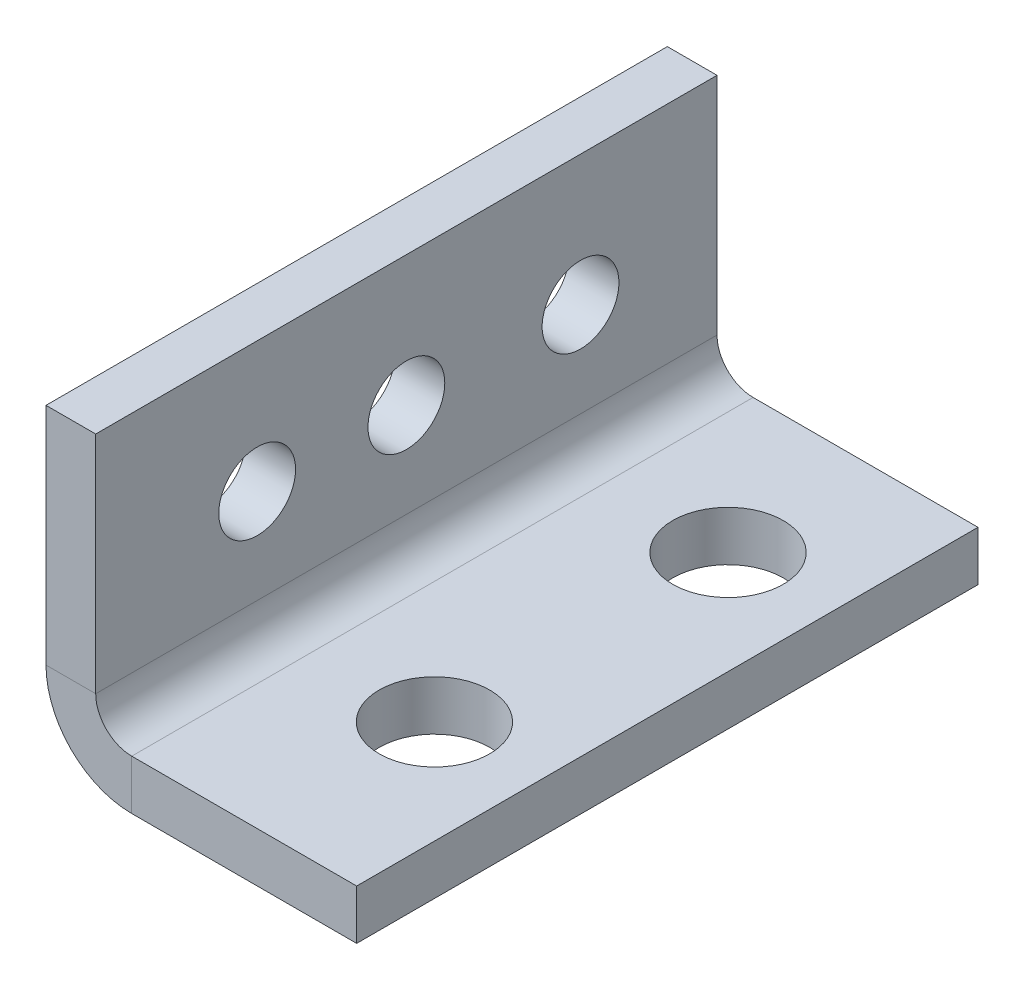
ISO-10303-21;
HEADER;
FILE_DESCRIPTION(('STEP AP214'),'2;1');
FILE_NAME('part.step','',(''),(''),'','','');
FILE_SCHEMA(('AUTOMOTIVE_DESIGN { 1 0 10303 214 1 1 1 1 }'));
ENDSEC;
DATA;
#1=APPLICATION_CONTEXT('core data for automotive mechanical design processes');
#2=APPLICATION_PROTOCOL_DEFINITION('international standard','automotive_design',2000,#1);
#3=PRODUCT_CONTEXT('',#1,'mechanical');
#4=PRODUCT('Part','Part','',(#3));
#5=PRODUCT_RELATED_PRODUCT_CATEGORY('part','',(#4));
#6=PRODUCT_DEFINITION_FORMATION('','',#4);
#7=PRODUCT_DEFINITION_CONTEXT('part definition',#1,'design');
#8=PRODUCT_DEFINITION('design','',#6,#7);
#9=PRODUCT_DEFINITION_SHAPE('','',#8);
#10=(LENGTH_UNIT() NAMED_UNIT(*) SI_UNIT(.MILLI.,.METRE.));
#11=(NAMED_UNIT(*) PLANE_ANGLE_UNIT() SI_UNIT($,.RADIAN.));
#12=(NAMED_UNIT(*) SI_UNIT($,.STERADIAN.) SOLID_ANGLE_UNIT());
#13=UNCERTAINTY_MEASURE_WITH_UNIT(LENGTH_MEASURE(1.E-05),#10,'distance_accuracy_value','');
#14=(GEOMETRIC_REPRESENTATION_CONTEXT(3) GLOBAL_UNCERTAINTY_ASSIGNED_CONTEXT((#13)) GLOBAL_UNIT_ASSIGNED_CONTEXT((#10,
#11,#12)) REPRESENTATION_CONTEXT('',''));
#15=CARTESIAN_POINT('',(0.,0.,0.));
#16=DIRECTION('',(0.,0.,1.));
#17=DIRECTION('',(1.,0.,0.));
#18=AXIS2_PLACEMENT_3D('',#15,#16,#17);
#19=CARTESIAN_POINT('',(-1.016,6.35,-12.7));
#20=DIRECTION('',(0.,0.,-1.));
#21=DIRECTION('',(-1.,0.,0.));
#22=AXIS2_PLACEMENT_3D('',#19,#20,#21);
#23=PLANE('',#22);
#24=DIRECTION('',(0.,1.,0.));
#25=VECTOR('',#24,1.);
#26=CARTESIAN_POINT('',(0.,6.35,-12.7));
#27=LINE('',#26,#25);
#28=CARTESIAN_POINT('',(0.,1.7526,-12.7));
#29=VERTEX_POINT('',#28);
#30=CARTESIAN_POINT('',(0.,6.35,-12.7));
#31=VERTEX_POINT('',#30);
#32=EDGE_CURVE('E106',#29,#31,#27,.T.);
#33=ORIENTED_EDGE('',*,*,#32,.F.);
#34=DIRECTION('',(-1.,0.,0.));
#35=VECTOR('',#34,1.);
#36=CARTESIAN_POINT('',(0.,1.7526,-12.7));
#37=LINE('',#36,#35);
#38=CARTESIAN_POINT('',(-1.016,1.7526,-12.7));
#39=VERTEX_POINT('',#38);
#40=EDGE_CURVE('E137',#29,#39,#37,.T.);
#41=ORIENTED_EDGE('',*,*,#40,.T.);
#42=DIRECTION('',(0.,1.,0.));
#43=VECTOR('',#42,1.);
#44=CARTESIAN_POINT('',(-1.016,6.35,-12.7));
#45=LINE('',#44,#43);
#46=CARTESIAN_POINT('',(-1.016,6.35,-12.7));
#47=VERTEX_POINT('',#46);
#48=EDGE_CURVE('E111',#39,#47,#45,.T.);
#49=ORIENTED_EDGE('',*,*,#48,.T.);
#50=DIRECTION('',(1.,0.,0.));
#51=VECTOR('',#50,1.);
#52=CARTESIAN_POINT('',(-1.016,6.35,-12.7));
#53=LINE('',#52,#51);
#54=EDGE_CURVE('E61',#47,#31,#53,.T.);
#55=ORIENTED_EDGE('',*,*,#54,.T.);
#56=EDGE_LOOP('',(#33,#41,#49,#55));
#57=FACE_BOUND('',#56,.T.);
#58=ADVANCED_FACE('F58',(#57),#23,.T.);
#59=CARTESIAN_POINT('',(-1.016,0.,0.));
#60=DIRECTION('',(-1.,0.,0.));
#61=DIRECTION('',(0.,0.,1.));
#62=AXIS2_PLACEMENT_3D('',#59,#60,#61);
#63=PLANE('',#62);
#64=CARTESIAN_POINT('',(-1.016,3.685,-3.3));
#65=DIRECTION('',(1.,0.,0.));
#66=DIRECTION('',(0.,0.,-1.));
#67=AXIS2_PLACEMENT_3D('',#64,#65,#66);
#68=CIRCLE('',#67,0.784999999999998);
#69=CARTESIAN_POINT('',(-1.016,3.685,-4.085));
#70=VERTEX_POINT('',#69);
#71=EDGE_CURVE('E116',#70,#70,#68,.T.);
#72=ORIENTED_EDGE('',*,*,#71,.T.);
#73=EDGE_LOOP('',(#72));
#74=FACE_BOUND('',#73,.T.);
#75=CARTESIAN_POINT('',(-1.016,3.685,-6.35));
#76=DIRECTION('',(1.,0.,0.));
#77=DIRECTION('',(0.,0.,-1.));
#78=AXIS2_PLACEMENT_3D('',#75,#76,#77);
#79=CIRCLE('',#78,0.784999999999999);
#80=CARTESIAN_POINT('',(-1.016,3.685,-7.135));
#81=VERTEX_POINT('',#80);
#82=EDGE_CURVE('E123',#81,#81,#79,.T.);
#83=ORIENTED_EDGE('',*,*,#82,.T.);
#84=EDGE_LOOP('',(#83));
#85=FACE_BOUND('',#84,.T.);
#86=CARTESIAN_POINT('',(-1.016,3.685,-9.91));
#87=DIRECTION('',(1.,0.,0.));
#88=DIRECTION('',(0.,0.,-1.));
#89=AXIS2_PLACEMENT_3D('',#86,#87,#88);
#90=CIRCLE('',#89,0.784999999999999);
#91=CARTESIAN_POINT('',(-1.016,3.685,-10.695));
#92=VERTEX_POINT('',#91);
#93=EDGE_CURVE('E129',#92,#92,#90,.T.);
#94=ORIENTED_EDGE('',*,*,#93,.T.);
#95=EDGE_LOOP('',(#94));
#96=FACE_BOUND('',#95,.T.);
#97=ORIENTED_EDGE('',*,*,#48,.F.);
#98=DIRECTION('',(0.,0.,-1.));
#99=VECTOR('',#98,1.);
#100=CARTESIAN_POINT('',(-1.016,1.7526,-12.7));
#101=LINE('',#100,#99);
#102=CARTESIAN_POINT('',(-1.016,1.7526,0.));
#103=VERTEX_POINT('',#102);
#104=EDGE_CURVE('E154',#39,#103,#101,.F.);
#105=ORIENTED_EDGE('',*,*,#104,.T.);
#106=DIRECTION('',(0.,-1.,0.));
#107=VECTOR('',#106,1.);
#108=CARTESIAN_POINT('',(-1.016,0.,0.));
#109=LINE('',#108,#107);
#110=CARTESIAN_POINT('',(-1.016,6.35,0.));
#111=VERTEX_POINT('',#110);
#112=EDGE_CURVE('E117',#111,#103,#109,.T.);
#113=ORIENTED_EDGE('',*,*,#112,.F.);
#114=DIRECTION('',(0.,0.,1.));
#115=VECTOR('',#114,1.);
#116=CARTESIAN_POINT('',(-1.016,6.35,0.));
#117=LINE('',#116,#115);
#118=EDGE_CURVE('E96',#47,#111,#117,.T.);
#119=ORIENTED_EDGE('',*,*,#118,.F.);
#120=EDGE_LOOP('',(#97,#105,#113,#119));
#121=FACE_BOUND('',#120,.T.);
#122=ADVANCED_FACE('F262',(#74,#85,#96,#121),#63,.T.);
#123=CARTESIAN_POINT('',(0.,0.,0.));
#124=DIRECTION('',(-1.,0.,0.));
#125=DIRECTION('',(0.,0.,1.));
#126=AXIS2_PLACEMENT_3D('',#123,#124,#125);
#127=PLANE('',#126);
#128=CARTESIAN_POINT('',(0.,3.685,-3.3));
#129=DIRECTION('',(1.,0.,0.));
#130=DIRECTION('',(0.,0.,-1.));
#131=AXIS2_PLACEMENT_3D('',#128,#129,#130);
#132=CIRCLE('',#131,0.784999999999998);
#133=CARTESIAN_POINT('',(0.,3.685,-4.085));
#134=VERTEX_POINT('',#133);
#135=EDGE_CURVE('E120',#134,#134,#132,.T.);
#136=ORIENTED_EDGE('',*,*,#135,.F.);
#137=EDGE_LOOP('',(#136));
#138=FACE_BOUND('',#137,.T.);
#139=CARTESIAN_POINT('',(0.,3.685,-6.35));
#140=DIRECTION('',(1.,0.,0.));
#141=DIRECTION('',(0.,0.,-1.));
#142=AXIS2_PLACEMENT_3D('',#139,#140,#141);
#143=CIRCLE('',#142,0.784999999999999);
#144=CARTESIAN_POINT('',(0.,3.685,-7.135));
#145=VERTEX_POINT('',#144);
#146=EDGE_CURVE('E126',#145,#145,#143,.T.);
#147=ORIENTED_EDGE('',*,*,#146,.F.);
#148=EDGE_LOOP('',(#147));
#149=FACE_BOUND('',#148,.T.);
#150=CARTESIAN_POINT('',(0.,3.685,-9.91));
#151=DIRECTION('',(1.,0.,0.));
#152=DIRECTION('',(0.,0.,-1.));
#153=AXIS2_PLACEMENT_3D('',#150,#151,#152);
#154=CIRCLE('',#153,0.784999999999999);
#155=CARTESIAN_POINT('',(0.,3.685,-10.695));
#156=VERTEX_POINT('',#155);
#157=EDGE_CURVE('E132',#156,#156,#154,.T.);
#158=ORIENTED_EDGE('',*,*,#157,.F.);
#159=EDGE_LOOP('',(#158));
#160=FACE_BOUND('',#159,.T.);
#161=DIRECTION('',(0.,0.,-1.));
#162=VECTOR('',#161,1.);
#163=CARTESIAN_POINT('',(0.,1.7526,-12.7));
#164=LINE('',#163,#162);
#165=CARTESIAN_POINT('',(0.,1.7526,0.));
#166=VERTEX_POINT('',#165);
#167=EDGE_CURVE('E144',#29,#166,#164,.F.);
#168=ORIENTED_EDGE('',*,*,#167,.F.);
#169=ORIENTED_EDGE('',*,*,#32,.T.);
#170=DIRECTION('',(0.,0.,1.));
#171=VECTOR('',#170,1.);
#172=CARTESIAN_POINT('',(0.,6.35,0.));
#173=LINE('',#172,#171);
#174=CARTESIAN_POINT('',(0.,6.35,0.));
#175=VERTEX_POINT('',#174);
#176=EDGE_CURVE('E94',#31,#175,#173,.T.);
#177=ORIENTED_EDGE('',*,*,#176,.T.);
#178=DIRECTION('',(0.,-1.,0.));
#179=VECTOR('',#178,1.);
#180=CARTESIAN_POINT('',(0.,0.,0.));
#181=LINE('',#180,#179);
#182=EDGE_CURVE('E103',#175,#166,#181,.T.);
#183=ORIENTED_EDGE('',*,*,#182,.T.);
#184=EDGE_LOOP('',(#168,#169,#177,#183));
#185=FACE_BOUND('',#184,.T.);
#186=ADVANCED_FACE('F101',(#138,#149,#160,#185),#127,.F.);
#187=CARTESIAN_POINT('',(-1.016,0.,0.));
#188=DIRECTION('',(0.,0.,1.));
#189=DIRECTION('',(1.,0.,0.));
#190=AXIS2_PLACEMENT_3D('',#187,#188,#189);
#191=PLANE('',#190);
#192=DIRECTION('',(-1.,0.,0.));
#193=VECTOR('',#192,1.);
#194=CARTESIAN_POINT('',(0.,1.7526,0.));
#195=LINE('',#194,#193);
#196=EDGE_CURVE('E110',#166,#103,#195,.T.);
#197=ORIENTED_EDGE('',*,*,#196,.F.);
#198=ORIENTED_EDGE('',*,*,#182,.F.);
#199=DIRECTION('',(1.,0.,0.));
#200=VECTOR('',#199,1.);
#201=CARTESIAN_POINT('',(-1.016,6.35,0.));
#202=LINE('',#201,#200);
#203=EDGE_CURVE('E13',#111,#175,#202,.T.);
#204=ORIENTED_EDGE('',*,*,#203,.F.);
#205=ORIENTED_EDGE('',*,*,#112,.T.);
#206=EDGE_LOOP('',(#197,#198,#204,#205));
#207=FACE_BOUND('',#206,.T.);
#208=ADVANCED_FACE('F109',(#207),#191,.T.);
#209=CARTESIAN_POINT('',(-1.016,6.35,0.));
#210=DIRECTION('',(0.,1.,0.));
#211=DIRECTION('',(0.,0.,1.));
#212=AXIS2_PLACEMENT_3D('',#209,#210,#211);
#213=PLANE('',#212);
#214=ORIENTED_EDGE('',*,*,#176,.F.);
#215=ORIENTED_EDGE('',*,*,#54,.F.);
#216=ORIENTED_EDGE('',*,*,#118,.T.);
#217=ORIENTED_EDGE('',*,*,#203,.T.);
#218=EDGE_LOOP('',(#214,#215,#216,#217));
#219=FACE_BOUND('',#218,.T.);
#220=ADVANCED_FACE('F92',(#219),#213,.T.);
#221=CARTESIAN_POINT('',(-1.016,3.685,-3.3));
#222=DIRECTION('',(1.,0.,0.));
#223=DIRECTION('',(0.,0.,-1.));
#224=AXIS2_PLACEMENT_3D('',#221,#222,#223);
#225=CYLINDRICAL_SURFACE('',#224,0.784999999999998);
#226=ORIENTED_EDGE('',*,*,#71,.F.);
#227=EDGE_LOOP('',(#226));
#228=FACE_BOUND('',#227,.T.);
#229=ORIENTED_EDGE('',*,*,#135,.T.);
#230=EDGE_LOOP('',(#229));
#231=FACE_BOUND('',#230,.T.);
#232=ADVANCED_FACE('F290',(#228,#231),#225,.F.);
#233=CARTESIAN_POINT('',(-1.016,3.685,-6.35));
#234=DIRECTION('',(1.,0.,0.));
#235=DIRECTION('',(0.,0.,-1.));
#236=AXIS2_PLACEMENT_3D('',#233,#234,#235);
#237=CYLINDRICAL_SURFACE('',#236,0.784999999999999);
#238=ORIENTED_EDGE('',*,*,#82,.F.);
#239=EDGE_LOOP('',(#238));
#240=FACE_BOUND('',#239,.T.);
#241=ORIENTED_EDGE('',*,*,#146,.T.);
#242=EDGE_LOOP('',(#241));
#243=FACE_BOUND('',#242,.T.);
#244=ADVANCED_FACE('F298',(#240,#243),#237,.F.);
#245=CARTESIAN_POINT('',(-1.016,3.685,-9.91));
#246=DIRECTION('',(1.,0.,0.));
#247=DIRECTION('',(0.,0.,-1.));
#248=AXIS2_PLACEMENT_3D('',#245,#246,#247);
#249=CYLINDRICAL_SURFACE('',#248,0.784999999999999);
#250=ORIENTED_EDGE('',*,*,#93,.F.);
#251=EDGE_LOOP('',(#250));
#252=FACE_BOUND('',#251,.T.);
#253=ORIENTED_EDGE('',*,*,#157,.T.);
#254=EDGE_LOOP('',(#253));
#255=FACE_BOUND('',#254,.T.);
#256=ADVANCED_FACE('F303',(#252,#255),#249,.F.);
#257=CARTESIAN_POINT('',(0.7366,1.7526,0.));
#258=DIRECTION('',(0.,0.,1.));
#259=DIRECTION('',(1.,0.,0.));
#260=AXIS2_PLACEMENT_3D('',#257,#258,#259);
#261=PLANE('',#260);
#262=DIRECTION('',(0.,1.,0.));
#263=VECTOR('',#262,1.);
#264=CARTESIAN_POINT('',(0.736599999999994,0.,0.));
#265=LINE('',#264,#263);
#266=CARTESIAN_POINT('',(0.736599999999997,1.016,0.));
#267=VERTEX_POINT('',#266);
#268=CARTESIAN_POINT('',(0.736599999999993,0.,0.));
#269=VERTEX_POINT('',#268);
#270=EDGE_CURVE('E158',#267,#269,#265,.F.);
#271=ORIENTED_EDGE('',*,*,#270,.F.);
#272=CARTESIAN_POINT('',(0.7366,1.7526,0.));
#273=DIRECTION('',(0.,0.,-1.));
#274=DIRECTION('',(-1.,0.,0.));
#275=AXIS2_PLACEMENT_3D('',#272,#273,#274);
#276=CIRCLE('',#275,0.7366);
#277=EDGE_CURVE('E148',#166,#267,#276,.F.);
#278=ORIENTED_EDGE('',*,*,#277,.F.);
#279=ORIENTED_EDGE('',*,*,#196,.T.);
#280=CARTESIAN_POINT('',(0.7366,1.7526,0.));
#281=DIRECTION('',(0.,0.,-1.));
#282=DIRECTION('',(-1.,0.,0.));
#283=AXIS2_PLACEMENT_3D('',#280,#281,#282);
#284=CIRCLE('',#283,1.7526);
#285=EDGE_CURVE('E72',#103,#269,#284,.F.);
#286=ORIENTED_EDGE('',*,*,#285,.T.);
#287=EDGE_LOOP('',(#271,#278,#279,#286));
#288=FACE_BOUND('',#287,.T.);
#289=ADVANCED_FACE('F265',(#288),#261,.T.);
#290=CARTESIAN_POINT('',(0.736600000000001,1.7526,-12.7));
#291=DIRECTION('',(0.,0.,1.));
#292=DIRECTION('',(1.,0.,0.));
#293=AXIS2_PLACEMENT_3D('',#290,#291,#292);
#294=PLANE('',#293);
#295=CARTESIAN_POINT('',(0.736600000000001,1.7526,-12.7));
#296=DIRECTION('',(0.,0.,-1.));
#297=DIRECTION('',(-1.,0.,0.));
#298=AXIS2_PLACEMENT_3D('',#295,#296,#297);
#299=CIRCLE('',#298,0.7366);
#300=CARTESIAN_POINT('',(0.736599999999998,1.016,-12.7));
#301=VERTEX_POINT('',#300);
#302=EDGE_CURVE('E141',#301,#29,#299,.T.);
#303=ORIENTED_EDGE('',*,*,#302,.F.);
#304=DIRECTION('',(0.,1.,0.));
#305=VECTOR('',#304,1.);
#306=CARTESIAN_POINT('',(0.736599999999998,1.016,-12.7));
#307=LINE('',#306,#305);
#308=CARTESIAN_POINT('',(0.736599999999994,0.,-12.7));
#309=VERTEX_POINT('',#308);
#310=EDGE_CURVE('E165',#301,#309,#307,.F.);
#311=ORIENTED_EDGE('',*,*,#310,.T.);
#312=CARTESIAN_POINT('',(0.736600000000001,1.7526,-12.7));
#313=DIRECTION('',(0.,0.,-1.));
#314=DIRECTION('',(-1.,0.,0.));
#315=AXIS2_PLACEMENT_3D('',#312,#313,#314);
#316=CIRCLE('',#315,1.7526);
#317=EDGE_CURVE('E151',#309,#39,#316,.T.);
#318=ORIENTED_EDGE('',*,*,#317,.T.);
#319=ORIENTED_EDGE('',*,*,#40,.F.);
#320=EDGE_LOOP('',(#303,#311,#318,#319));
#321=FACE_BOUND('',#320,.T.);
#322=ADVANCED_FACE('F255',(#321),#294,.F.);
#323=CARTESIAN_POINT('',(0.736600000000001,1.7526,-12.7));
#324=DIRECTION('',(0.,0.,-1.));
#325=DIRECTION('',(0.,-1.,0.));
#326=AXIS2_PLACEMENT_3D('',#323,#324,#325);
#327=CYLINDRICAL_SURFACE('',#326,1.7526);
#328=ORIENTED_EDGE('',*,*,#104,.F.);
#329=ORIENTED_EDGE('',*,*,#317,.F.);
#330=DIRECTION('',(0.,0.,-1.));
#331=VECTOR('',#330,1.);
#332=CARTESIAN_POINT('',(0.736599999999994,0.,0.));
#333=LINE('',#332,#331);
#334=EDGE_CURVE('E168',#309,#269,#333,.F.);
#335=ORIENTED_EDGE('',*,*,#334,.T.);
#336=ORIENTED_EDGE('',*,*,#285,.F.);
#337=EDGE_LOOP('',(#328,#329,#335,#336));
#338=FACE_BOUND('',#337,.T.);
#339=ADVANCED_FACE('F263',(#338),#327,.T.);
#340=CARTESIAN_POINT('',(0.736600000000001,1.7526,-12.7));
#341=DIRECTION('',(0.,0.,-1.));
#342=DIRECTION('',(0.,-1.,0.));
#343=AXIS2_PLACEMENT_3D('',#340,#341,#342);
#344=CYLINDRICAL_SURFACE('',#343,0.7366);
#345=ORIENTED_EDGE('',*,*,#167,.T.);
#346=ORIENTED_EDGE('',*,*,#277,.T.);
#347=DIRECTION('',(0.,0.,-1.));
#348=VECTOR('',#347,1.);
#349=CARTESIAN_POINT('',(0.736599999999997,1.016,0.));
#350=LINE('',#349,#348);
#351=EDGE_CURVE('E161',#267,#301,#350,.T.);
#352=ORIENTED_EDGE('',*,*,#351,.T.);
#353=ORIENTED_EDGE('',*,*,#302,.T.);
#354=EDGE_LOOP('',(#345,#346,#352,#353));
#355=FACE_BOUND('',#354,.T.);
#356=ADVANCED_FACE('F259',(#355),#344,.F.);
#357=CARTESIAN_POINT('',(0.,0.,0.));
#358=DIRECTION('',(0.,0.,-1.));
#359=DIRECTION('',(0.,1.,0.));
#360=AXIS2_PLACEMENT_3D('',#357,#358,#359);
#361=PLANE('',#360);
#362=ORIENTED_EDGE('',*,*,#270,.T.);
#363=DIRECTION('',(-1.,0.,0.));
#364=VECTOR('',#363,1.);
#365=CARTESIAN_POINT('',(0.,0.,0.));
#366=LINE('',#365,#364);
#367=CARTESIAN_POINT('',(5.334,0.,0.));
#368=VERTEX_POINT('',#367);
#369=EDGE_CURVE('E179',#368,#269,#366,.T.);
#370=ORIENTED_EDGE('',*,*,#369,.F.);
#371=DIRECTION('',(0.,1.,0.));
#372=VECTOR('',#371,1.);
#373=CARTESIAN_POINT('',(5.334,0.,0.));
#374=LINE('',#373,#372);
#375=CARTESIAN_POINT('',(5.334,1.01599999999998,0.));
#376=VERTEX_POINT('',#375);
#377=EDGE_CURVE('E188',#368,#376,#374,.T.);
#378=ORIENTED_EDGE('',*,*,#377,.T.);
#379=DIRECTION('',(1.,0.,0.));
#380=VECTOR('',#379,1.);
#381=CARTESIAN_POINT('',(0.,1.016,0.));
#382=LINE('',#381,#380);
#383=EDGE_CURVE('E170',#376,#267,#382,.F.);
#384=ORIENTED_EDGE('',*,*,#383,.T.);
#385=EDGE_LOOP('',(#362,#370,#378,#384));
#386=FACE_BOUND('',#385,.T.);
#387=ADVANCED_FACE('F267',(#386),#361,.F.);
#388=CARTESIAN_POINT('',(5.334,0.,-12.7));
#389=DIRECTION('',(0.,0.,1.));
#390=DIRECTION('',(0.,-1.,0.));
#391=AXIS2_PLACEMENT_3D('',#388,#389,#390);
#392=PLANE('',#391);
#393=ORIENTED_EDGE('',*,*,#310,.F.);
#394=DIRECTION('',(-1.,0.,0.));
#395=VECTOR('',#394,1.);
#396=CARTESIAN_POINT('',(5.334,1.01599999999998,-12.7));
#397=LINE('',#396,#395);
#398=CARTESIAN_POINT('',(5.334,1.01599999999998,-12.7));
#399=VERTEX_POINT('',#398);
#400=EDGE_CURVE('E173',#301,#399,#397,.F.);
#401=ORIENTED_EDGE('',*,*,#400,.T.);
#402=DIRECTION('',(0.,1.,0.));
#403=VECTOR('',#402,1.);
#404=CARTESIAN_POINT('',(5.334,0.,-12.7));
#405=LINE('',#404,#403);
#406=CARTESIAN_POINT('',(5.334,0.,-12.7));
#407=VERTEX_POINT('',#406);
#408=EDGE_CURVE('E145',#407,#399,#405,.T.);
#409=ORIENTED_EDGE('',*,*,#408,.F.);
#410=DIRECTION('',(1.,0.,0.));
#411=VECTOR('',#410,1.);
#412=CARTESIAN_POINT('',(0.,0.,-12.7));
#413=LINE('',#412,#411);
#414=EDGE_CURVE('E182',#309,#407,#413,.T.);
#415=ORIENTED_EDGE('',*,*,#414,.F.);
#416=EDGE_LOOP('',(#393,#401,#409,#415));
#417=FACE_BOUND('',#416,.T.);
#418=ADVANCED_FACE('F227',(#417),#392,.F.);
#419=CARTESIAN_POINT('',(0.,0.,0.));
#420=DIRECTION('',(0.,1.,0.));
#421=DIRECTION('',(-1.,0.,0.));
#422=AXIS2_PLACEMENT_3D('',#419,#420,#421);
#423=PLANE('',#422);
#424=CARTESIAN_POINT('',(3.22399999999998,0.,-9.7));
#425=DIRECTION('',(0.,1.,0.));
#426=DIRECTION('',(-1.,0.,0.));
#427=AXIS2_PLACEMENT_3D('',#424,#425,#426);
#428=CIRCLE('',#427,1.13);
#429=CARTESIAN_POINT('',(2.09399999999998,0.,-9.7));
#430=VERTEX_POINT('',#429);
#431=EDGE_CURVE('E198',#430,#430,#428,.F.);
#432=ORIENTED_EDGE('',*,*,#431,.F.);
#433=EDGE_LOOP('',(#432));
#434=FACE_BOUND('',#433,.T.);
#435=CARTESIAN_POINT('',(3.22399999999998,0.,-3.7));
#436=DIRECTION('',(0.,1.,0.));
#437=DIRECTION('',(-1.,0.,0.));
#438=AXIS2_PLACEMENT_3D('',#435,#436,#437);
#439=CIRCLE('',#438,1.13);
#440=CARTESIAN_POINT('',(2.09399999999998,0.,-3.7));
#441=VERTEX_POINT('',#440);
#442=EDGE_CURVE('E162',#441,#441,#439,.F.);
#443=ORIENTED_EDGE('',*,*,#442,.F.);
#444=EDGE_LOOP('',(#443));
#445=FACE_BOUND('',#444,.T.);
#446=ORIENTED_EDGE('',*,*,#334,.F.);
#447=ORIENTED_EDGE('',*,*,#414,.T.);
#448=DIRECTION('',(0.,0.,1.));
#449=VECTOR('',#448,1.);
#450=CARTESIAN_POINT('',(5.334,0.,0.));
#451=LINE('',#450,#449);
#452=EDGE_CURVE('E185',#407,#368,#451,.T.);
#453=ORIENTED_EDGE('',*,*,#452,.T.);
#454=ORIENTED_EDGE('',*,*,#369,.T.);
#455=EDGE_LOOP('',(#446,#447,#453,#454));
#456=FACE_BOUND('',#455,.T.);
#457=ADVANCED_FACE('F212',(#434,#445,#456),#423,.F.);
#458=CARTESIAN_POINT('',(0.,1.016,0.));
#459=DIRECTION('',(0.,1.,0.));
#460=DIRECTION('',(-1.,0.,0.));
#461=AXIS2_PLACEMENT_3D('',#458,#459,#460);
#462=PLANE('',#461);
#463=CARTESIAN_POINT('',(3.22399999999998,1.01599999999999,-9.7));
#464=DIRECTION('',(0.,1.,0.));
#465=DIRECTION('',(-1.,0.,0.));
#466=AXIS2_PLACEMENT_3D('',#463,#464,#465);
#467=CIRCLE('',#466,1.13);
#468=CARTESIAN_POINT('',(2.09399999999998,1.01599999999999,-9.7));
#469=VERTEX_POINT('',#468);
#470=EDGE_CURVE('E201',#469,#469,#467,.T.);
#471=ORIENTED_EDGE('',*,*,#470,.F.);
#472=EDGE_LOOP('',(#471));
#473=FACE_BOUND('',#472,.T.);
#474=CARTESIAN_POINT('',(3.22399999999998,1.01599999999999,-3.7));
#475=DIRECTION('',(0.,1.,0.));
#476=DIRECTION('',(-1.,0.,0.));
#477=AXIS2_PLACEMENT_3D('',#474,#475,#476);
#478=CIRCLE('',#477,1.13);
#479=CARTESIAN_POINT('',(2.09399999999998,1.01599999999999,-3.7));
#480=VERTEX_POINT('',#479);
#481=EDGE_CURVE('E195',#480,#480,#478,.T.);
#482=ORIENTED_EDGE('',*,*,#481,.F.);
#483=EDGE_LOOP('',(#482));
#484=FACE_BOUND('',#483,.T.);
#485=ORIENTED_EDGE('',*,*,#400,.F.);
#486=ORIENTED_EDGE('',*,*,#351,.F.);
#487=ORIENTED_EDGE('',*,*,#383,.F.);
#488=DIRECTION('',(0.,0.,-1.));
#489=VECTOR('',#488,1.);
#490=CARTESIAN_POINT('',(5.334,1.01599999999998,0.));
#491=LINE('',#490,#489);
#492=EDGE_CURVE('E176',#399,#376,#491,.F.);
#493=ORIENTED_EDGE('',*,*,#492,.F.);
#494=EDGE_LOOP('',(#485,#486,#487,#493));
#495=FACE_BOUND('',#494,.T.);
#496=ADVANCED_FACE('F208',(#473,#484,#495),#462,.T.);
#497=CARTESIAN_POINT('',(5.334,0.,0.));
#498=DIRECTION('',(-1.,0.,0.));
#499=DIRECTION('',(0.,-1.,0.));
#500=AXIS2_PLACEMENT_3D('',#497,#498,#499);
#501=PLANE('',#500);
#502=ORIENTED_EDGE('',*,*,#492,.T.);
#503=ORIENTED_EDGE('',*,*,#377,.F.);
#504=ORIENTED_EDGE('',*,*,#452,.F.);
#505=ORIENTED_EDGE('',*,*,#408,.T.);
#506=EDGE_LOOP('',(#502,#503,#504,#505));
#507=FACE_BOUND('',#506,.T.);
#508=ADVANCED_FACE('F211',(#507),#501,.F.);
#509=CARTESIAN_POINT('',(3.22399999999998,-0.00100000000003418,-3.7));
#510=DIRECTION('',(0.,1.,0.));
#511=DIRECTION('',(-1.,0.,0.));
#512=AXIS2_PLACEMENT_3D('',#509,#510,#511);
#513=CYLINDRICAL_SURFACE('',#512,1.13);
#514=ORIENTED_EDGE('',*,*,#481,.T.);
#515=EDGE_LOOP('',(#514));
#516=FACE_BOUND('',#515,.T.);
#517=ORIENTED_EDGE('',*,*,#442,.T.);
#518=EDGE_LOOP('',(#517));
#519=FACE_BOUND('',#518,.T.);
#520=ADVANCED_FACE('F356',(#516,#519),#513,.F.);
#521=CARTESIAN_POINT('',(3.22399999999998,-0.00100000000003439,-9.7));
#522=DIRECTION('',(0.,1.,0.));
#523=DIRECTION('',(-1.,0.,0.));
#524=AXIS2_PLACEMENT_3D('',#521,#522,#523);
#525=CYLINDRICAL_SURFACE('',#524,1.13);
#526=ORIENTED_EDGE('',*,*,#470,.T.);
#527=EDGE_LOOP('',(#526));
#528=FACE_BOUND('',#527,.T.);
#529=ORIENTED_EDGE('',*,*,#431,.T.);
#530=EDGE_LOOP('',(#529));
#531=FACE_BOUND('',#530,.T.);
#532=ADVANCED_FACE('F205',(#528,#531),#525,.F.);
#533=CLOSED_SHELL('',(#58,#122,#186,#208,#220,#232,#244,#256,#289,#322,#339,#356,#387,#418,#457,
#496,#508,#520,#532));
#534=MANIFOLD_SOLID_BREP('B2',#533);
#535=ADVANCED_BREP_SHAPE_REPRESENTATION('',(#18,#534),#14);
#536=SHAPE_DEFINITION_REPRESENTATION(#9,#535);
ENDSEC;
END-ISO-10303-21;
